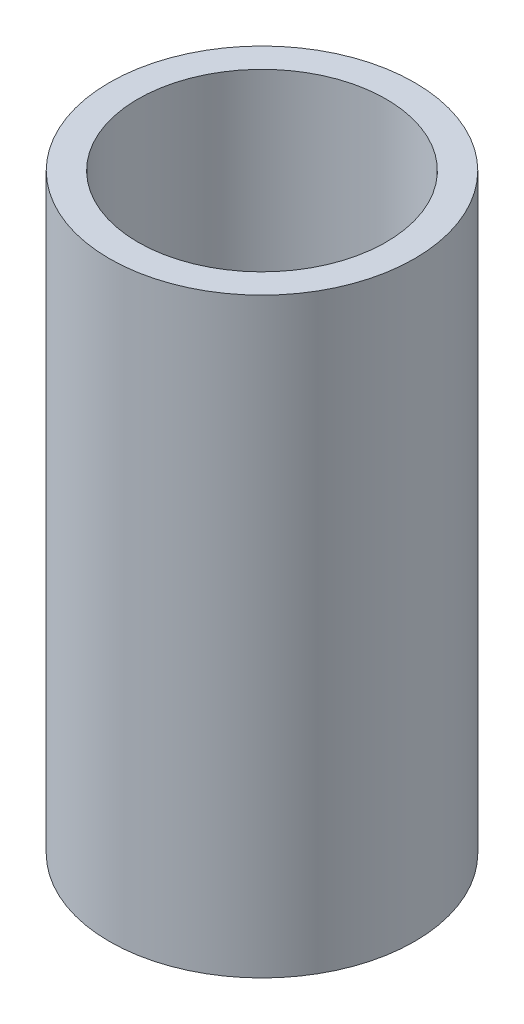
ISO-10303-21;
HEADER;
FILE_DESCRIPTION(('STEP AP214'),'2;1');
FILE_NAME('part.step','',(''),(''),'','','');
FILE_SCHEMA(('AUTOMOTIVE_DESIGN { 1 0 10303 214 1 1 1 1 }'));
ENDSEC;
DATA;
#1=APPLICATION_CONTEXT('core data for automotive mechanical design processes');
#2=APPLICATION_PROTOCOL_DEFINITION('international standard','automotive_design',2000,#1);
#3=PRODUCT_CONTEXT('',#1,'mechanical');
#4=PRODUCT('Part','Part','',(#3));
#5=PRODUCT_RELATED_PRODUCT_CATEGORY('part','',(#4));
#6=PRODUCT_DEFINITION_FORMATION('','',#4);
#7=PRODUCT_DEFINITION_CONTEXT('part definition',#1,'design');
#8=PRODUCT_DEFINITION('design','',#6,#7);
#9=PRODUCT_DEFINITION_SHAPE('','',#8);
#10=(LENGTH_UNIT() NAMED_UNIT(*) SI_UNIT(.MILLI.,.METRE.));
#11=(NAMED_UNIT(*) PLANE_ANGLE_UNIT() SI_UNIT($,.RADIAN.));
#12=(NAMED_UNIT(*) SI_UNIT($,.STERADIAN.) SOLID_ANGLE_UNIT());
#13=UNCERTAINTY_MEASURE_WITH_UNIT(LENGTH_MEASURE(1.E-05),#10,'distance_accuracy_value','');
#14=(GEOMETRIC_REPRESENTATION_CONTEXT(3) GLOBAL_UNCERTAINTY_ASSIGNED_CONTEXT((#13)) GLOBAL_UNIT_ASSIGNED_CONTEXT((#10,
#11,#12)) REPRESENTATION_CONTEXT('',''));
#15=CARTESIAN_POINT('',(0.,0.,0.));
#16=DIRECTION('',(0.,0.,1.));
#17=DIRECTION('',(1.,0.,0.));
#18=AXIS2_PLACEMENT_3D('',#15,#16,#17);
#19=CARTESIAN_POINT('',(0.,67.8207075177554,0.));
#20=DIRECTION('',(0.,-1.,0.));
#21=DIRECTION('',(0.,0.,-1.));
#22=AXIS2_PLACEMENT_3D('',#19,#20,#21);
#23=CYLINDRICAL_SURFACE('',#22,17.5);
#24=CARTESIAN_POINT('',(0.,67.8207075177554,0.));
#25=DIRECTION('',(0.,1.,0.));
#26=DIRECTION('',(0.,0.,1.));
#27=AXIS2_PLACEMENT_3D('',#24,#25,#26);
#28=CIRCLE('',#27,17.5);
#29=CARTESIAN_POINT('',(0.,67.8207075177554,17.5));
#30=VERTEX_POINT('',#29);
#31=EDGE_CURVE('E10',#30,#30,#28,.T.);
#32=ORIENTED_EDGE('',*,*,#31,.F.);
#33=EDGE_LOOP('',(#32));
#34=FACE_BOUND('',#33,.T.);
#35=CARTESIAN_POINT('',(0.,0.,0.));
#36=DIRECTION('',(0.,1.,0.));
#37=DIRECTION('',(0.,0.,1.));
#38=AXIS2_PLACEMENT_3D('',#35,#36,#37);
#39=CIRCLE('',#38,17.5);
#40=CARTESIAN_POINT('',(0.,0.,17.5));
#41=VERTEX_POINT('',#40);
#42=EDGE_CURVE('E37',#41,#41,#39,.T.);
#43=ORIENTED_EDGE('',*,*,#42,.T.);
#44=EDGE_LOOP('',(#43));
#45=FACE_BOUND('',#44,.T.);
#46=ADVANCED_FACE('F40',(#34,#45),#23,.T.);
#47=CARTESIAN_POINT('',(0.,67.8207075177554,0.));
#48=DIRECTION('',(0.,1.,0.));
#49=DIRECTION('',(0.,0.,1.));
#50=AXIS2_PLACEMENT_3D('',#47,#48,#49);
#51=PLANE('',#50);
#52=CARTESIAN_POINT('',(0.,67.8207075177554,0.));
#53=DIRECTION('',(0.,1.,0.));
#54=DIRECTION('',(0.,0.,1.));
#55=AXIS2_PLACEMENT_3D('',#52,#53,#54);
#56=CIRCLE('',#55,14.2271411770051);
#57=CARTESIAN_POINT('',(0.,67.8207075177554,14.2271411770051));
#58=VERTEX_POINT('',#57);
#59=EDGE_CURVE('E50',#58,#58,#56,.T.);
#60=ORIENTED_EDGE('',*,*,#59,.F.);
#61=EDGE_LOOP('',(#60));
#62=FACE_BOUND('',#61,.T.);
#63=ORIENTED_EDGE('',*,*,#31,.T.);
#64=EDGE_LOOP('',(#63));
#65=FACE_BOUND('',#64,.T.);
#66=ADVANCED_FACE('F59',(#62,#65),#51,.T.);
#67=CARTESIAN_POINT('',(0.,0.,0.));
#68=DIRECTION('',(0.,1.,0.));
#69=DIRECTION('',(0.,0.,1.));
#70=AXIS2_PLACEMENT_3D('',#67,#68,#69);
#71=PLANE('',#70);
#72=CARTESIAN_POINT('',(0.,0.,0.));
#73=DIRECTION('',(0.,1.,0.));
#74=DIRECTION('',(0.,0.,1.));
#75=AXIS2_PLACEMENT_3D('',#72,#73,#74);
#76=CIRCLE('',#75,14.2271411770051);
#77=CARTESIAN_POINT('',(0.,0.,14.2271411770051));
#78=VERTEX_POINT('',#77);
#79=EDGE_CURVE('E47',#78,#78,#76,.T.);
#80=ORIENTED_EDGE('',*,*,#79,.T.);
#81=EDGE_LOOP('',(#80));
#82=FACE_BOUND('',#81,.T.);
#83=ORIENTED_EDGE('',*,*,#42,.F.);
#84=EDGE_LOOP('',(#83));
#85=FACE_BOUND('',#84,.T.);
#86=ADVANCED_FACE('F58',(#82,#85),#71,.F.);
#87=CARTESIAN_POINT('',(0.,67.8207075177554,0.));
#88=DIRECTION('',(0.,-1.,0.));
#89=DIRECTION('',(0.,0.,-1.));
#90=AXIS2_PLACEMENT_3D('',#87,#88,#89);
#91=CYLINDRICAL_SURFACE('',#90,14.2271411770051);
#92=ORIENTED_EDGE('',*,*,#59,.T.);
#93=EDGE_LOOP('',(#92));
#94=FACE_BOUND('',#93,.T.);
#95=ORIENTED_EDGE('',*,*,#79,.F.);
#96=EDGE_LOOP('',(#95));
#97=FACE_BOUND('',#96,.T.);
#98=ADVANCED_FACE('F54',(#94,#97),#91,.F.);
#99=CLOSED_SHELL('',(#46,#66,#86,#98));
#100=MANIFOLD_SOLID_BREP('B2',#99);
#101=ADVANCED_BREP_SHAPE_REPRESENTATION('',(#18,#100),#14);
#102=SHAPE_DEFINITION_REPRESENTATION(#9,#101);
ENDSEC;
END-ISO-10303-21;
